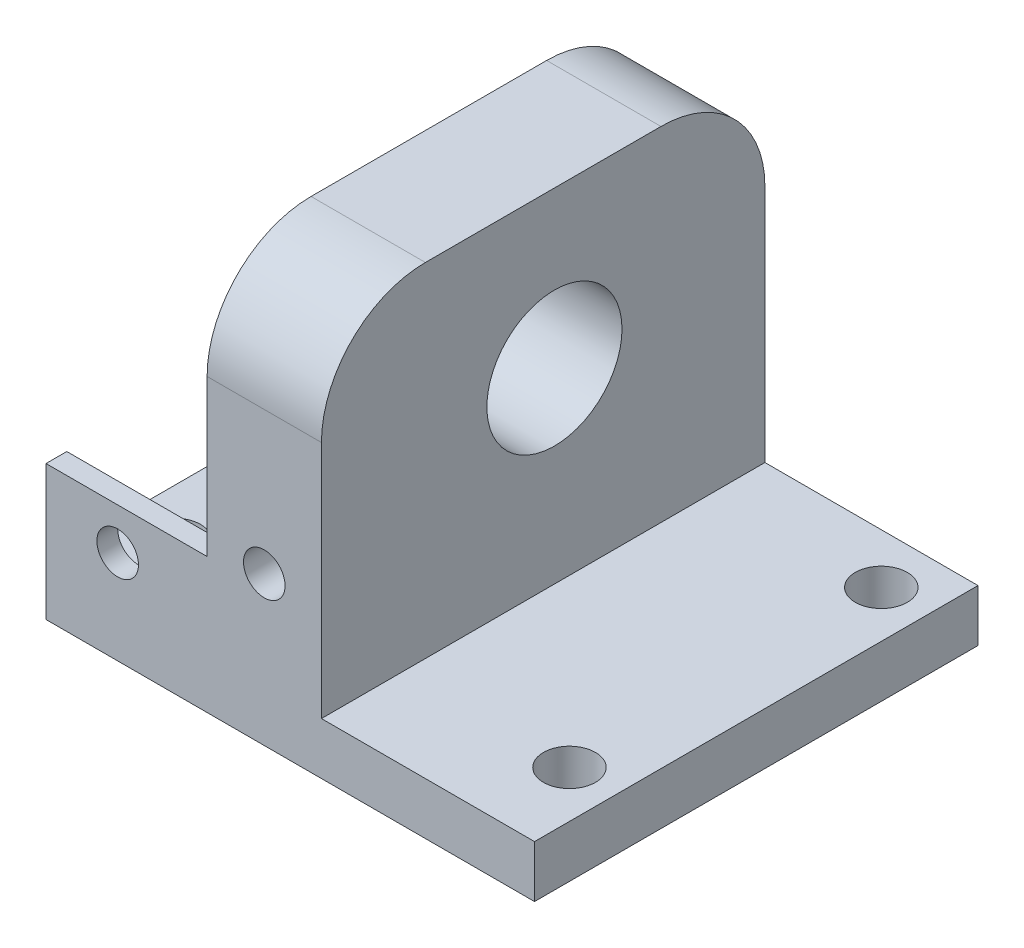
ISO-10303-21;
HEADER;
FILE_DESCRIPTION(('STEP AP214'),'2;1');
FILE_NAME('part.step','',(''),(''),'','','');
FILE_SCHEMA(('AUTOMOTIVE_DESIGN { 1 0 10303 214 1 1 1 1 }'));
ENDSEC;
DATA;
#1=APPLICATION_CONTEXT('core data for automotive mechanical design processes');
#2=APPLICATION_PROTOCOL_DEFINITION('international standard','automotive_design',2000,#1);
#3=PRODUCT_CONTEXT('',#1,'mechanical');
#4=PRODUCT('Part','Part','',(#3));
#5=PRODUCT_RELATED_PRODUCT_CATEGORY('part','',(#4));
#6=PRODUCT_DEFINITION_FORMATION('','',#4);
#7=PRODUCT_DEFINITION_CONTEXT('part definition',#1,'design');
#8=PRODUCT_DEFINITION('design','',#6,#7);
#9=PRODUCT_DEFINITION_SHAPE('','',#8);
#10=(LENGTH_UNIT() NAMED_UNIT(*) SI_UNIT(.MILLI.,.METRE.));
#11=(NAMED_UNIT(*) PLANE_ANGLE_UNIT() SI_UNIT($,.RADIAN.));
#12=(NAMED_UNIT(*) SI_UNIT($,.STERADIAN.) SOLID_ANGLE_UNIT());
#13=UNCERTAINTY_MEASURE_WITH_UNIT(LENGTH_MEASURE(1.E-05),#10,'distance_accuracy_value','');
#14=(GEOMETRIC_REPRESENTATION_CONTEXT(3) GLOBAL_UNCERTAINTY_ASSIGNED_CONTEXT((#13)) GLOBAL_UNIT_ASSIGNED_CONTEXT((#10,
#11,#12)) REPRESENTATION_CONTEXT('',''));
#15=CARTESIAN_POINT('',(0.,0.,0.));
#16=DIRECTION('',(0.,0.,1.));
#17=DIRECTION('',(1.,0.,0.));
#18=AXIS2_PLACEMENT_3D('',#15,#16,#17);
#19=CARTESIAN_POINT('',(0.,13.,0.));
#20=DIRECTION('',(0.,1.,0.));
#21=DIRECTION('',(0.,0.,-1.));
#22=AXIS2_PLACEMENT_3D('',#19,#20,#21);
#23=PLANE('',#22);
#24=CARTESIAN_POINT('',(-10.,13.,25.7045662951631));
#25=DIRECTION('',(0.,-1.,0.));
#26=DIRECTION('',(0.,0.,-1.));
#27=AXIS2_PLACEMENT_3D('',#24,#25,#26);
#28=CIRCLE('',#27,2.);
#29=CARTESIAN_POINT('',(-10.,13.,27.7045662951631));
#30=VERTEX_POINT('',#29);
#31=CARTESIAN_POINT('',(-8.,13.,25.7045662951631));
#32=VERTEX_POINT('',#31);
#33=EDGE_CURVE('E242',#30,#32,#28,.F.);
#34=ORIENTED_EDGE('',*,*,#33,.F.);
#35=DIRECTION('',(1.,0.,0.));
#36=VECTOR('',#35,1.);
#37=CARTESIAN_POINT('',(0.,13.,27.7045662951631));
#38=LINE('',#37,#36);
#39=CARTESIAN_POINT('',(-23.5,13.,27.7045662951631));
#40=VERTEX_POINT('',#39);
#41=EDGE_CURVE('E166',#40,#30,#38,.T.);
#42=ORIENTED_EDGE('',*,*,#41,.F.);
#43=DIRECTION('',(0.,0.,1.));
#44=VECTOR('',#43,1.);
#45=CARTESIAN_POINT('',(-23.5,13.,0.));
#46=LINE('',#45,#44);
#47=CARTESIAN_POINT('',(-23.5,13.,29.7045662951631));
#48=VERTEX_POINT('',#47);
#49=EDGE_CURVE('E160',#40,#48,#46,.T.);
#50=ORIENTED_EDGE('',*,*,#49,.T.);
#51=DIRECTION('',(-1.,0.,0.));
#52=VECTOR('',#51,1.);
#53=CARTESIAN_POINT('',(0.,13.,29.7045662951631));
#54=LINE('',#53,#52);
#55=CARTESIAN_POINT('',(-8.,13.,29.7045662951631));
#56=VERTEX_POINT('',#55);
#57=EDGE_CURVE('E142',#56,#48,#54,.T.);
#58=ORIENTED_EDGE('',*,*,#57,.F.);
#59=DIRECTION('',(0.,0.,-1.));
#60=VECTOR('',#59,1.);
#61=CARTESIAN_POINT('',(-8.,13.,22.2925073687534));
#62=LINE('',#61,#60);
#63=EDGE_CURVE('E146',#56,#32,#62,.T.);
#64=ORIENTED_EDGE('',*,*,#63,.T.);
#65=EDGE_LOOP('',(#34,#42,#50,#58,#64));
#66=FACE_BOUND('',#65,.T.);
#67=ADVANCED_FACE('F43',(#66),#23,.T.);
#68=CARTESIAN_POINT('',(0.,38.,27.7045662951631));
#69=DIRECTION('',(0.,0.,1.));
#70=DIRECTION('',(-1.,0.,0.));
#71=AXIS2_PLACEMENT_3D('',#68,#69,#70);
#72=PLANE('',#71);
#73=CARTESIAN_POINT('',(-16.6031759190852,9.,27.7045662951631));
#74=DIRECTION('',(0.,0.,-1.));
#75=DIRECTION('',(-1.,0.,0.));
#76=AXIS2_PLACEMENT_3D('',#73,#74,#75);
#77=CIRCLE('',#76,2.);
#78=CARTESIAN_POINT('',(-18.6031759190852,9.,27.7045662951631));
#79=VERTEX_POINT('',#78);
#80=EDGE_CURVE('E156',#79,#79,#77,.T.);
#81=ORIENTED_EDGE('',*,*,#80,.F.);
#82=EDGE_LOOP('',(#81));
#83=FACE_BOUND('',#82,.T.);
#84=DIRECTION('',(1.,0.,0.));
#85=VECTOR('',#84,1.);
#86=CARTESIAN_POINT('',(0.,5.,27.7045662951631));
#87=LINE('',#86,#85);
#88=CARTESIAN_POINT('',(-23.5,5.,27.7045662951631));
#89=VERTEX_POINT('',#88);
#90=CARTESIAN_POINT('',(-10.,5.,27.7045662951631));
#91=VERTEX_POINT('',#90);
#92=EDGE_CURVE('E174',#89,#91,#87,.T.);
#93=ORIENTED_EDGE('',*,*,#92,.F.);
#94=DIRECTION('',(0.,-1.,0.));
#95=VECTOR('',#94,1.);
#96=CARTESIAN_POINT('',(-23.5,38.,27.7045662951631));
#97=LINE('',#96,#95);
#98=EDGE_CURVE('E180',#40,#89,#97,.T.);
#99=ORIENTED_EDGE('',*,*,#98,.F.);
#100=ORIENTED_EDGE('',*,*,#41,.T.);
#101=DIRECTION('',(0.,-1.,0.));
#102=VECTOR('',#101,1.);
#103=CARTESIAN_POINT('',(-10.,13.,27.7045662951631));
#104=LINE('',#103,#102);
#105=EDGE_CURVE('E240',#91,#30,#104,.F.);
#106=ORIENTED_EDGE('',*,*,#105,.F.);
#107=EDGE_LOOP('',(#93,#99,#100,#106));
#108=FACE_BOUND('',#107,.T.);
#109=ADVANCED_FACE('F280',(#83,#108),#72,.F.);
#110=CARTESIAN_POINT('',(0.,5.,0.));
#111=DIRECTION('',(0.,1.,0.));
#112=DIRECTION('',(0.,0.,-1.));
#113=AXIS2_PLACEMENT_3D('',#110,#111,#112);
#114=PLANE('',#113);
#115=CARTESIAN_POINT('',(-19.,5.,21.8424323695947));
#116=DIRECTION('',(0.,-1.,0.));
#117=DIRECTION('',(0.,0.,-1.));
#118=AXIS2_PLACEMENT_3D('',#115,#116,#117);
#119=CIRCLE('',#118,2.5);
#120=CARTESIAN_POINT('',(-19.,5.,19.3424323695947));
#121=VERTEX_POINT('',#120);
#122=EDGE_CURVE('E194',#121,#121,#119,.T.);
#123=ORIENTED_EDGE('',*,*,#122,.T.);
#124=EDGE_LOOP('',(#123));
#125=FACE_BOUND('',#124,.T.);
#126=CARTESIAN_POINT('',(-19.,5.,-8.15756763040534));
#127=DIRECTION('',(0.,-1.,0.));
#128=DIRECTION('',(0.,0.,-1.));
#129=AXIS2_PLACEMENT_3D('',#126,#127,#128);
#130=CIRCLE('',#129,2.5);
#131=CARTESIAN_POINT('',(-19.,5.,-10.6575676304053));
#132=VERTEX_POINT('',#131);
#133=EDGE_CURVE('E187',#132,#132,#130,.T.);
#134=ORIENTED_EDGE('',*,*,#133,.T.);
#135=EDGE_LOOP('',(#134));
#136=FACE_BOUND('',#135,.T.);
#137=DIRECTION('',(0.,0.,-1.));
#138=VECTOR('',#137,1.);
#139=CARTESIAN_POINT('',(-8.,5.,27.7045662951631));
#140=LINE('',#139,#138);
#141=CARTESIAN_POINT('',(-8.,5.,25.7045662951631));
#142=VERTEX_POINT('',#141);
#143=CARTESIAN_POINT('',(-8.,5.,-12.9607154678039));
#144=VERTEX_POINT('',#143);
#145=EDGE_CURVE('E272',#142,#144,#140,.T.);
#146=ORIENTED_EDGE('',*,*,#145,.T.);
#147=DIRECTION('',(-1.,0.,0.));
#148=VECTOR('',#147,1.);
#149=CARTESIAN_POINT('',(0.,5.,-12.9607154678039));
#150=LINE('',#149,#148);
#151=CARTESIAN_POINT('',(-23.5,5.,-12.9607154678039));
#152=VERTEX_POINT('',#151);
#153=EDGE_CURVE('E199',#144,#152,#150,.T.);
#154=ORIENTED_EDGE('',*,*,#153,.T.);
#155=DIRECTION('',(0.,0.,1.));
#156=VECTOR('',#155,1.);
#157=CARTESIAN_POINT('',(-23.5,5.,0.));
#158=LINE('',#157,#156);
#159=EDGE_CURVE('E197',#152,#89,#158,.T.);
#160=ORIENTED_EDGE('',*,*,#159,.T.);
#161=ORIENTED_EDGE('',*,*,#92,.T.);
#162=CARTESIAN_POINT('',(-10.,5.,25.7045662951631));
#163=DIRECTION('',(0.,-1.,0.));
#164=DIRECTION('',(0.,0.,-1.));
#165=AXIS2_PLACEMENT_3D('',#162,#163,#164);
#166=CIRCLE('',#165,2.);
#167=EDGE_CURVE('E238',#142,#91,#166,.T.);
#168=ORIENTED_EDGE('',*,*,#167,.F.);
#169=EDGE_LOOP('',(#146,#154,#160,#161,#168));
#170=FACE_BOUND('',#169,.T.);
#171=ADVANCED_FACE('F286',(#125,#136,#170),#114,.T.);
#172=CARTESIAN_POINT('',(-23.5,5.,0.));
#173=DIRECTION('',(-1.,0.,0.));
#174=DIRECTION('',(0.,0.,-1.));
#175=AXIS2_PLACEMENT_3D('',#172,#173,#174);
#176=PLANE('',#175);
#177=ORIENTED_EDGE('',*,*,#98,.T.);
#178=ORIENTED_EDGE('',*,*,#159,.F.);
#179=DIRECTION('',(0.,-1.,0.));
#180=VECTOR('',#179,1.);
#181=CARTESIAN_POINT('',(-23.5,5.,-12.9607154678039));
#182=LINE('',#181,#180);
#183=CARTESIAN_POINT('',(-23.5,0.,-12.9607154678039));
#184=VERTEX_POINT('',#183);
#185=EDGE_CURVE('E234',#152,#184,#182,.T.);
#186=ORIENTED_EDGE('',*,*,#185,.T.);
#187=DIRECTION('',(0.,0.,1.));
#188=VECTOR('',#187,1.);
#189=CARTESIAN_POINT('',(-23.5,0.,0.));
#190=LINE('',#189,#188);
#191=CARTESIAN_POINT('',(-23.5,0.,29.7045662951631));
#192=VERTEX_POINT('',#191);
#193=EDGE_CURVE('E218',#184,#192,#190,.T.);
#194=ORIENTED_EDGE('',*,*,#193,.T.);
#195=DIRECTION('',(0.,-1.,0.));
#196=VECTOR('',#195,1.);
#197=CARTESIAN_POINT('',(-23.5,5.,29.7045662951631));
#198=LINE('',#197,#196);
#199=EDGE_CURVE('E206',#48,#192,#198,.T.);
#200=ORIENTED_EDGE('',*,*,#199,.F.);
#201=ORIENTED_EDGE('',*,*,#49,.F.);
#202=EDGE_LOOP('',(#177,#178,#186,#194,#200,#201));
#203=FACE_BOUND('',#202,.T.);
#204=ADVANCED_FACE('F319',(#203),#176,.T.);
#205=CARTESIAN_POINT('',(23.5,5.,0.));
#206=DIRECTION('',(-1.,0.,0.));
#207=DIRECTION('',(0.,0.,-1.));
#208=AXIS2_PLACEMENT_3D('',#205,#206,#207);
#209=PLANE('',#208);
#210=DIRECTION('',(0.,-1.,0.));
#211=VECTOR('',#210,1.);
#212=CARTESIAN_POINT('',(23.5,5.,29.7045662951631));
#213=LINE('',#212,#211);
#214=CARTESIAN_POINT('',(23.5,5.,29.7045662951631));
#215=VERTEX_POINT('',#214);
#216=CARTESIAN_POINT('',(23.5,0.,29.7045662951631));
#217=VERTEX_POINT('',#216);
#218=EDGE_CURVE('E228',#215,#217,#213,.T.);
#219=ORIENTED_EDGE('',*,*,#218,.T.);
#220=DIRECTION('',(0.,0.,1.));
#221=VECTOR('',#220,1.);
#222=CARTESIAN_POINT('',(23.5,0.,0.));
#223=LINE('',#222,#221);
#224=CARTESIAN_POINT('',(23.5,0.,-12.9607154678039));
#225=VERTEX_POINT('',#224);
#226=EDGE_CURVE('E223',#225,#217,#223,.T.);
#227=ORIENTED_EDGE('',*,*,#226,.F.);
#228=DIRECTION('',(0.,-1.,0.));
#229=VECTOR('',#228,1.);
#230=CARTESIAN_POINT('',(23.5,5.,-12.9607154678039));
#231=LINE('',#230,#229);
#232=CARTESIAN_POINT('',(23.5,5.,-12.9607154678039));
#233=VERTEX_POINT('',#232);
#234=EDGE_CURVE('E231',#233,#225,#231,.T.);
#235=ORIENTED_EDGE('',*,*,#234,.F.);
#236=DIRECTION('',(0.,0.,1.));
#237=VECTOR('',#236,1.);
#238=CARTESIAN_POINT('',(23.5,5.,0.));
#239=LINE('',#238,#237);
#240=EDGE_CURVE('E203',#233,#215,#239,.T.);
#241=ORIENTED_EDGE('',*,*,#240,.T.);
#242=EDGE_LOOP('',(#219,#227,#235,#241));
#243=FACE_BOUND('',#242,.T.);
#244=ADVANCED_FACE('F341',(#243),#209,.F.);
#245=CARTESIAN_POINT('',(0.,5.,29.7045662951631));
#246=DIRECTION('',(0.,0.,-1.));
#247=DIRECTION('',(1.,0.,0.));
#248=AXIS2_PLACEMENT_3D('',#245,#246,#247);
#249=PLANE('',#248);
#250=CARTESIAN_POINT('',(-16.6031759190852,9.,29.7045662951631));
#251=DIRECTION('',(0.,0.,-1.));
#252=DIRECTION('',(-1.,0.,0.));
#253=AXIS2_PLACEMENT_3D('',#250,#251,#252);
#254=CIRCLE('',#253,2.);
#255=CARTESIAN_POINT('',(-18.6031759190852,9.,29.7045662951631));
#256=VERTEX_POINT('',#255);
#257=EDGE_CURVE('E294',#256,#256,#254,.T.);
#258=ORIENTED_EDGE('',*,*,#257,.T.);
#259=EDGE_LOOP('',(#258));
#260=FACE_BOUND('',#259,.T.);
#261=CARTESIAN_POINT('',(-2.5,14.3094116682529,29.7045662951631));
#262=DIRECTION('',(0.,0.,-1.));
#263=DIRECTION('',(-1.,0.,0.));
#264=AXIS2_PLACEMENT_3D('',#261,#262,#263);
#265=CIRCLE('',#264,2.);
#266=CARTESIAN_POINT('',(-4.5,14.3094116682529,29.7045662951631));
#267=VERTEX_POINT('',#266);
#268=EDGE_CURVE('E295',#267,#267,#265,.T.);
#269=ORIENTED_EDGE('',*,*,#268,.T.);
#270=EDGE_LOOP('',(#269));
#271=FACE_BOUND('',#270,.T.);
#272=DIRECTION('',(0.,-1.,0.));
#273=VECTOR('',#272,1.);
#274=CARTESIAN_POINT('',(-8.,38.,29.7045662951631));
#275=LINE('',#274,#273);
#276=CARTESIAN_POINT('',(-8.,28.,29.7045662951631));
#277=VERTEX_POINT('',#276);
#278=EDGE_CURVE('E137',#277,#56,#275,.T.);
#279=ORIENTED_EDGE('',*,*,#278,.T.);
#280=ORIENTED_EDGE('',*,*,#57,.T.);
#281=ORIENTED_EDGE('',*,*,#199,.T.);
#282=DIRECTION('',(-1.,0.,0.));
#283=VECTOR('',#282,1.);
#284=CARTESIAN_POINT('',(0.,0.,29.7045662951631));
#285=LINE('',#284,#283);
#286=EDGE_CURVE('E188',#217,#192,#285,.T.);
#287=ORIENTED_EDGE('',*,*,#286,.F.);
#288=ORIENTED_EDGE('',*,*,#218,.F.);
#289=DIRECTION('',(1.,0.,0.));
#290=VECTOR('',#289,1.);
#291=CARTESIAN_POINT('',(0.,5.,29.7045662951631));
#292=LINE('',#291,#290);
#293=CARTESIAN_POINT('',(3.,5.,29.7045662951631));
#294=VERTEX_POINT('',#293);
#295=EDGE_CURVE('E270',#294,#215,#292,.T.);
#296=ORIENTED_EDGE('',*,*,#295,.F.);
#297=DIRECTION('',(0.,-1.,0.));
#298=VECTOR('',#297,1.);
#299=CARTESIAN_POINT('',(3.,5.,29.7045662951631));
#300=LINE('',#299,#298);
#301=CARTESIAN_POINT('',(3.,28.,29.7045662951631));
#302=VERTEX_POINT('',#301);
#303=EDGE_CURVE('E266',#302,#294,#300,.T.);
#304=ORIENTED_EDGE('',*,*,#303,.F.);
#305=DIRECTION('',(-1.,0.,0.));
#306=VECTOR('',#305,1.);
#307=CARTESIAN_POINT('',(3.,28.,29.7045662951631));
#308=LINE('',#307,#306);
#309=EDGE_CURVE('E11',#277,#302,#308,.F.);
#310=ORIENTED_EDGE('',*,*,#309,.F.);
#311=EDGE_LOOP('',(#279,#280,#281,#287,#288,#296,#304,#310));
#312=FACE_BOUND('',#311,.T.);
#313=ADVANCED_FACE('F139',(#260,#271,#312),#249,.F.);
#314=CARTESIAN_POINT('',(0.,5.,-12.9607154678039));
#315=DIRECTION('',(0.,0.,-1.));
#316=DIRECTION('',(1.,0.,0.));
#317=AXIS2_PLACEMENT_3D('',#314,#315,#316);
#318=PLANE('',#317);
#319=DIRECTION('',(0.,-1.,0.));
#320=VECTOR('',#319,1.);
#321=CARTESIAN_POINT('',(3.,38.,-12.9607154678039));
#322=LINE('',#321,#320);
#323=CARTESIAN_POINT('',(3.,28.,-12.9607154678039));
#324=VERTEX_POINT('',#323);
#325=CARTESIAN_POINT('',(3.,5.,-12.9607154678039));
#326=VERTEX_POINT('',#325);
#327=EDGE_CURVE('E173',#324,#326,#322,.T.);
#328=ORIENTED_EDGE('',*,*,#327,.T.);
#329=EDGE_CURVE('E200',#233,#326,#150,.T.);
#330=ORIENTED_EDGE('',*,*,#329,.F.);
#331=ORIENTED_EDGE('',*,*,#234,.T.);
#332=DIRECTION('',(-1.,0.,0.));
#333=VECTOR('',#332,1.);
#334=CARTESIAN_POINT('',(0.,0.,-12.9607154678039));
#335=LINE('',#334,#333);
#336=EDGE_CURVE('E221',#225,#184,#335,.T.);
#337=ORIENTED_EDGE('',*,*,#336,.T.);
#338=ORIENTED_EDGE('',*,*,#185,.F.);
#339=ORIENTED_EDGE('',*,*,#153,.F.);
#340=DIRECTION('',(0.,1.,0.));
#341=VECTOR('',#340,1.);
#342=CARTESIAN_POINT('',(-8.,5.,-12.9607154678039));
#343=LINE('',#342,#341);
#344=CARTESIAN_POINT('',(-8.,28.,-12.9607154678039));
#345=VERTEX_POINT('',#344);
#346=EDGE_CURVE('E267',#144,#345,#343,.T.);
#347=ORIENTED_EDGE('',*,*,#346,.T.);
#348=DIRECTION('',(1.,0.,0.));
#349=VECTOR('',#348,1.);
#350=CARTESIAN_POINT('',(0.,28.,-12.9607154678039));
#351=LINE('',#350,#349);
#352=EDGE_CURVE('E253',#324,#345,#351,.F.);
#353=ORIENTED_EDGE('',*,*,#352,.F.);
#354=EDGE_LOOP('',(#328,#330,#331,#337,#338,#339,#347,#353));
#355=FACE_BOUND('',#354,.T.);
#356=ADVANCED_FACE('F340',(#355),#318,.T.);
#357=CARTESIAN_POINT('',(-19.,5.,21.8424323695947));
#358=DIRECTION('',(0.,-1.,0.));
#359=DIRECTION('',(0.,0.,1.));
#360=AXIS2_PLACEMENT_3D('',#357,#358,#359);
#361=CYLINDRICAL_SURFACE('',#360,2.5);
#362=ORIENTED_EDGE('',*,*,#122,.F.);
#363=EDGE_LOOP('',(#362));
#364=FACE_BOUND('',#363,.T.);
#365=CARTESIAN_POINT('',(-19.,0.,21.8424323695947));
#366=DIRECTION('',(0.,-1.,0.));
#367=DIRECTION('',(0.,0.,-1.));
#368=AXIS2_PLACEMENT_3D('',#365,#366,#367);
#369=CIRCLE('',#368,2.5);
#370=CARTESIAN_POINT('',(-19.,0.,19.3424323695947));
#371=VERTEX_POINT('',#370);
#372=EDGE_CURVE('E215',#371,#371,#369,.T.);
#373=ORIENTED_EDGE('',*,*,#372,.T.);
#374=EDGE_LOOP('',(#373));
#375=FACE_BOUND('',#374,.T.);
#376=ADVANCED_FACE('F347',(#364,#375),#361,.F.);
#377=CARTESIAN_POINT('',(19.,5.,21.8424323695946));
#378=DIRECTION('',(0.,-1.,0.));
#379=DIRECTION('',(0.,0.,1.));
#380=AXIS2_PLACEMENT_3D('',#377,#378,#379);
#381=CYLINDRICAL_SURFACE('',#380,2.5);
#382=CARTESIAN_POINT('',(19.,5.,21.8424323695946));
#383=DIRECTION('',(0.,-1.,0.));
#384=DIRECTION('',(0.,0.,-1.));
#385=AXIS2_PLACEMENT_3D('',#382,#383,#384);
#386=CIRCLE('',#385,2.5);
#387=CARTESIAN_POINT('',(19.,5.,19.3424323695946));
#388=VERTEX_POINT('',#387);
#389=EDGE_CURVE('E191',#388,#388,#386,.T.);
#390=ORIENTED_EDGE('',*,*,#389,.F.);
#391=EDGE_LOOP('',(#390));
#392=FACE_BOUND('',#391,.T.);
#393=CARTESIAN_POINT('',(19.,0.,21.8424323695946));
#394=DIRECTION('',(0.,-1.,0.));
#395=DIRECTION('',(0.,0.,-1.));
#396=AXIS2_PLACEMENT_3D('',#393,#394,#395);
#397=CIRCLE('',#396,2.5);
#398=CARTESIAN_POINT('',(19.,0.,19.3424323695946));
#399=VERTEX_POINT('',#398);
#400=EDGE_CURVE('E212',#399,#399,#397,.T.);
#401=ORIENTED_EDGE('',*,*,#400,.T.);
#402=EDGE_LOOP('',(#401));
#403=FACE_BOUND('',#402,.T.);
#404=ADVANCED_FACE('F354',(#392,#403),#381,.F.);
#405=CARTESIAN_POINT('',(-19.,5.,-8.15756763040534));
#406=DIRECTION('',(0.,-1.,0.));
#407=DIRECTION('',(0.,0.,1.));
#408=AXIS2_PLACEMENT_3D('',#405,#406,#407);
#409=CYLINDRICAL_SURFACE('',#408,2.5);
#410=ORIENTED_EDGE('',*,*,#133,.F.);
#411=EDGE_LOOP('',(#410));
#412=FACE_BOUND('',#411,.T.);
#413=CARTESIAN_POINT('',(-19.,0.,-8.15756763040534));
#414=DIRECTION('',(0.,-1.,0.));
#415=DIRECTION('',(0.,0.,-1.));
#416=AXIS2_PLACEMENT_3D('',#413,#414,#415);
#417=CIRCLE('',#416,2.5);
#418=CARTESIAN_POINT('',(-19.,0.,-10.6575676304053));
#419=VERTEX_POINT('',#418);
#420=EDGE_CURVE('E209',#419,#419,#417,.T.);
#421=ORIENTED_EDGE('',*,*,#420,.T.);
#422=EDGE_LOOP('',(#421));
#423=FACE_BOUND('',#422,.T.);
#424=ADVANCED_FACE('F358',(#412,#423),#409,.F.);
#425=CARTESIAN_POINT('',(19.,5.,-8.15756763040534));
#426=DIRECTION('',(0.,-1.,0.));
#427=DIRECTION('',(0.,0.,1.));
#428=AXIS2_PLACEMENT_3D('',#425,#426,#427);
#429=CYLINDRICAL_SURFACE('',#428,2.5);
#430=CARTESIAN_POINT('',(19.,5.,-8.15756763040534));
#431=DIRECTION('',(0.,-1.,0.));
#432=DIRECTION('',(0.,0.,-1.));
#433=AXIS2_PLACEMENT_3D('',#430,#431,#432);
#434=CIRCLE('',#433,2.5);
#435=CARTESIAN_POINT('',(19.,5.,-10.6575676304053));
#436=VERTEX_POINT('',#435);
#437=EDGE_CURVE('E184',#436,#436,#434,.T.);
#438=ORIENTED_EDGE('',*,*,#437,.F.);
#439=EDGE_LOOP('',(#438));
#440=FACE_BOUND('',#439,.T.);
#441=CARTESIAN_POINT('',(19.,0.,-8.15756763040534));
#442=DIRECTION('',(0.,-1.,0.));
#443=DIRECTION('',(0.,0.,-1.));
#444=AXIS2_PLACEMENT_3D('',#441,#442,#443);
#445=CIRCLE('',#444,2.5);
#446=CARTESIAN_POINT('',(19.,0.,-10.6575676304053));
#447=VERTEX_POINT('',#446);
#448=EDGE_CURVE('E183',#447,#447,#445,.T.);
#449=ORIENTED_EDGE('',*,*,#448,.T.);
#450=EDGE_LOOP('',(#449));
#451=FACE_BOUND('',#450,.T.);
#452=ADVANCED_FACE('F333',(#440,#451),#429,.F.);
#453=DIRECTION('',(0.,0.,1.));
#454=VECTOR('',#453,1.);
#455=CARTESIAN_POINT('',(3.,5.,0.));
#456=LINE('',#455,#454);
#457=EDGE_CURVE('E164',#326,#294,#456,.T.);
#458=ORIENTED_EDGE('',*,*,#457,.T.);
#459=ORIENTED_EDGE('',*,*,#295,.T.);
#460=ORIENTED_EDGE('',*,*,#240,.F.);
#461=ORIENTED_EDGE('',*,*,#329,.T.);
#462=EDGE_LOOP('',(#458,#459,#460,#461));
#463=FACE_BOUND('',#462,.T.);
#464=ORIENTED_EDGE('',*,*,#437,.T.);
#465=EDGE_LOOP('',(#464));
#466=FACE_BOUND('',#465,.T.);
#467=ORIENTED_EDGE('',*,*,#389,.T.);
#468=EDGE_LOOP('',(#467));
#469=FACE_BOUND('',#468,.T.);
#470=ADVANCED_FACE('F322',(#463,#466,#469),#114,.T.);
#471=CARTESIAN_POINT('',(0.,0.,0.));
#472=DIRECTION('',(0.,1.,0.));
#473=DIRECTION('',(0.,0.,-1.));
#474=AXIS2_PLACEMENT_3D('',#471,#472,#473);
#475=PLANE('',#474);
#476=ORIENTED_EDGE('',*,*,#448,.F.);
#477=EDGE_LOOP('',(#476));
#478=FACE_BOUND('',#477,.T.);
#479=ORIENTED_EDGE('',*,*,#420,.F.);
#480=EDGE_LOOP('',(#479));
#481=FACE_BOUND('',#480,.T.);
#482=ORIENTED_EDGE('',*,*,#400,.F.);
#483=EDGE_LOOP('',(#482));
#484=FACE_BOUND('',#483,.T.);
#485=ORIENTED_EDGE('',*,*,#372,.F.);
#486=EDGE_LOOP('',(#485));
#487=FACE_BOUND('',#486,.T.);
#488=ORIENTED_EDGE('',*,*,#193,.F.);
#489=ORIENTED_EDGE('',*,*,#336,.F.);
#490=ORIENTED_EDGE('',*,*,#226,.T.);
#491=ORIENTED_EDGE('',*,*,#286,.T.);
#492=EDGE_LOOP('',(#488,#489,#490,#491));
#493=FACE_BOUND('',#492,.T.);
#494=ADVANCED_FACE('F329',(#478,#481,#484,#487,#493),#475,.F.);
#495=CARTESIAN_POINT('',(3.,38.,0.));
#496=DIRECTION('',(-1.,0.,0.));
#497=DIRECTION('',(0.,0.,-1.));
#498=AXIS2_PLACEMENT_3D('',#495,#496,#497);
#499=PLANE('',#498);
#500=DIRECTION('',(0.,0.,1.));
#501=VECTOR('',#500,1.);
#502=CARTESIAN_POINT('',(3.,38.,0.));
#503=LINE('',#502,#501);
#504=CARTESIAN_POINT('',(3.,38.,-2.96071546780391));
#505=VERTEX_POINT('',#504);
#506=CARTESIAN_POINT('',(3.,38.,19.7045662951631));
#507=VERTEX_POINT('',#506);
#508=EDGE_CURVE('E170',#505,#507,#503,.T.);
#509=ORIENTED_EDGE('',*,*,#508,.T.);
#510=CARTESIAN_POINT('',(3.,28.,19.7045662951631));
#511=DIRECTION('',(1.,0.,0.));
#512=DIRECTION('',(0.,0.,-1.));
#513=AXIS2_PLACEMENT_3D('',#510,#511,#512);
#514=CIRCLE('',#513,10.);
#515=EDGE_CURVE('E248',#302,#507,#514,.F.);
#516=ORIENTED_EDGE('',*,*,#515,.F.);
#517=ORIENTED_EDGE('',*,*,#303,.T.);
#518=ORIENTED_EDGE('',*,*,#457,.F.);
#519=ORIENTED_EDGE('',*,*,#327,.F.);
#520=CARTESIAN_POINT('',(3.,28.,-2.96071546780391));
#521=DIRECTION('',(1.,0.,0.));
#522=DIRECTION('',(0.,0.,-1.));
#523=AXIS2_PLACEMENT_3D('',#520,#521,#522);
#524=CIRCLE('',#523,10.);
#525=EDGE_CURVE('E251',#505,#324,#524,.F.);
#526=ORIENTED_EDGE('',*,*,#525,.F.);
#527=EDGE_LOOP('',(#509,#516,#517,#518,#519,#526));
#528=FACE_BOUND('',#527,.T.);
#529=CARTESIAN_POINT('',(3.,22.9956029714957,7.28945850344098));
#530=DIRECTION('',(1.,0.,0.));
#531=DIRECTION('',(0.,0.,-1.));
#532=AXIS2_PLACEMENT_3D('',#529,#530,#531);
#533=CIRCLE('',#532,6.5);
#534=CARTESIAN_POINT('',(3.,22.9956029714957,0.789458503440981));
#535=VERTEX_POINT('',#534);
#536=EDGE_CURVE('E161',#535,#535,#533,.T.);
#537=ORIENTED_EDGE('',*,*,#536,.F.);
#538=EDGE_LOOP('',(#537));
#539=FACE_BOUND('',#538,.T.);
#540=ADVANCED_FACE('F327',(#528,#539),#499,.F.);
#541=CARTESIAN_POINT('',(0.,38.,0.));
#542=DIRECTION('',(0.,1.,0.));
#543=DIRECTION('',(0.,0.,-1.));
#544=AXIS2_PLACEMENT_3D('',#541,#542,#543);
#545=PLANE('',#544);
#546=DIRECTION('',(0.,0.,1.));
#547=VECTOR('',#546,1.);
#548=CARTESIAN_POINT('',(-8.,38.,-12.9607154678039));
#549=LINE('',#548,#547);
#550=CARTESIAN_POINT('',(-8.,38.,-2.96071546780391));
#551=VERTEX_POINT('',#550);
#552=CARTESIAN_POINT('',(-8.,38.,19.7045662951631));
#553=VERTEX_POINT('',#552);
#554=EDGE_CURVE('E265',#551,#553,#549,.T.);
#555=ORIENTED_EDGE('',*,*,#554,.T.);
#556=DIRECTION('',(-1.,0.,0.));
#557=VECTOR('',#556,1.);
#558=CARTESIAN_POINT('',(-8.,38.,19.7045662951631));
#559=LINE('',#558,#557);
#560=EDGE_CURVE('E244',#507,#553,#559,.T.);
#561=ORIENTED_EDGE('',*,*,#560,.F.);
#562=ORIENTED_EDGE('',*,*,#508,.F.);
#563=DIRECTION('',(1.,0.,0.));
#564=VECTOR('',#563,1.);
#565=CARTESIAN_POINT('',(0.,38.,-2.96071546780391));
#566=LINE('',#565,#564);
#567=EDGE_CURVE('E246',#551,#505,#566,.T.);
#568=ORIENTED_EDGE('',*,*,#567,.F.);
#569=EDGE_LOOP('',(#555,#561,#562,#568));
#570=FACE_BOUND('',#569,.T.);
#571=ADVANCED_FACE('F264',(#570),#545,.T.);
#572=CARTESIAN_POINT('',(4.,22.9956029714957,7.28945850344098));
#573=DIRECTION('',(-1.,0.,0.));
#574=DIRECTION('',(0.,0.,-1.));
#575=AXIS2_PLACEMENT_3D('',#572,#573,#574);
#576=CYLINDRICAL_SURFACE('',#575,6.5);
#577=ORIENTED_EDGE('',*,*,#536,.T.);
#578=EDGE_LOOP('',(#577));
#579=FACE_BOUND('',#578,.T.);
#580=CARTESIAN_POINT('',(-8.,22.9956029714957,7.28945850344098));
#581=DIRECTION('',(1.,0.,0.));
#582=DIRECTION('',(0.,0.,-1.));
#583=AXIS2_PLACEMENT_3D('',#580,#581,#582);
#584=CIRCLE('',#583,6.5);
#585=CARTESIAN_POINT('',(-8.,22.9956029714957,0.789458503440981));
#586=VERTEX_POINT('',#585);
#587=EDGE_CURVE('E145',#586,#586,#584,.T.);
#588=ORIENTED_EDGE('',*,*,#587,.F.);
#589=EDGE_LOOP('',(#588));
#590=FACE_BOUND('',#589,.T.);
#591=ADVANCED_FACE('F404',(#579,#590),#576,.F.);
#592=CARTESIAN_POINT('',(-8.,0.,0.));
#593=DIRECTION('',(1.,0.,0.));
#594=DIRECTION('',(0.,0.,1.));
#595=AXIS2_PLACEMENT_3D('',#592,#593,#594);
#596=PLANE('',#595);
#597=ORIENTED_EDGE('',*,*,#346,.F.);
#598=ORIENTED_EDGE('',*,*,#145,.F.);
#599=DIRECTION('',(0.,-1.,0.));
#600=VECTOR('',#599,1.);
#601=CARTESIAN_POINT('',(-8.,5.,25.7045662951631));
#602=LINE('',#601,#600);
#603=EDGE_CURVE('E152',#32,#142,#602,.T.);
#604=ORIENTED_EDGE('',*,*,#603,.F.);
#605=ORIENTED_EDGE('',*,*,#63,.F.);
#606=ORIENTED_EDGE('',*,*,#278,.F.);
#607=CARTESIAN_POINT('',(-8.,28.,19.7045662951631));
#608=DIRECTION('',(-1.,0.,0.));
#609=DIRECTION('',(0.,0.,1.));
#610=AXIS2_PLACEMENT_3D('',#607,#608,#609);
#611=CIRCLE('',#610,10.);
#612=EDGE_CURVE('E57',#553,#277,#611,.F.);
#613=ORIENTED_EDGE('',*,*,#612,.F.);
#614=ORIENTED_EDGE('',*,*,#554,.F.);
#615=CARTESIAN_POINT('',(-8.,28.,-2.96071546780391));
#616=DIRECTION('',(-1.,0.,0.));
#617=DIRECTION('',(0.,0.,1.));
#618=AXIS2_PLACEMENT_3D('',#615,#616,#617);
#619=CIRCLE('',#618,10.);
#620=EDGE_CURVE('E51',#345,#551,#619,.F.);
#621=ORIENTED_EDGE('',*,*,#620,.F.);
#622=EDGE_LOOP('',(#597,#598,#604,#605,#606,#613,#614,#621));
#623=FACE_BOUND('',#622,.T.);
#624=ORIENTED_EDGE('',*,*,#587,.T.);
#625=EDGE_LOOP('',(#624));
#626=FACE_BOUND('',#625,.T.);
#627=ADVANCED_FACE('F149',(#623,#626),#596,.F.);
#628=CARTESIAN_POINT('',(-10.,0.,25.7045662951631));
#629=DIRECTION('',(0.,1.,0.));
#630=DIRECTION('',(0.,0.,-1.));
#631=AXIS2_PLACEMENT_3D('',#628,#629,#630);
#632=CYLINDRICAL_SURFACE('',#631,2.);
#633=ORIENTED_EDGE('',*,*,#33,.T.);
#634=ORIENTED_EDGE('',*,*,#603,.T.);
#635=ORIENTED_EDGE('',*,*,#167,.T.);
#636=ORIENTED_EDGE('',*,*,#105,.T.);
#637=EDGE_LOOP('',(#633,#634,#635,#636));
#638=FACE_BOUND('',#637,.T.);
#639=ADVANCED_FACE('F282',(#638),#632,.F.);
#640=CARTESIAN_POINT('',(0.,28.,-2.96071546780391));
#641=DIRECTION('',(1.,0.,0.));
#642=DIRECTION('',(0.,0.,1.));
#643=AXIS2_PLACEMENT_3D('',#640,#641,#642);
#644=CYLINDRICAL_SURFACE('',#643,10.);
#645=ORIENTED_EDGE('',*,*,#620,.T.);
#646=ORIENTED_EDGE('',*,*,#567,.T.);
#647=ORIENTED_EDGE('',*,*,#525,.T.);
#648=ORIENTED_EDGE('',*,*,#352,.T.);
#649=EDGE_LOOP('',(#645,#646,#647,#648));
#650=FACE_BOUND('',#649,.T.);
#651=ADVANCED_FACE('F257',(#650),#644,.T.);
#652=CARTESIAN_POINT('',(0.,28.,19.7045662951631));
#653=DIRECTION('',(1.,0.,0.));
#654=DIRECTION('',(0.,0.,1.));
#655=AXIS2_PLACEMENT_3D('',#652,#653,#654);
#656=CYLINDRICAL_SURFACE('',#655,10.);
#657=ORIENTED_EDGE('',*,*,#515,.T.);
#658=ORIENTED_EDGE('',*,*,#560,.T.);
#659=ORIENTED_EDGE('',*,*,#612,.T.);
#660=ORIENTED_EDGE('',*,*,#309,.T.);
#661=EDGE_LOOP('',(#657,#658,#659,#660));
#662=FACE_BOUND('',#661,.T.);
#663=ADVANCED_FACE('F45',(#662),#656,.T.);
#664=CARTESIAN_POINT('',(-2.5,14.3094116682529,25.7045662951631));
#665=DIRECTION('',(0.,0.,1.));
#666=DIRECTION('',(-1.,0.,0.));
#667=AXIS2_PLACEMENT_3D('',#664,#665,#666);
#668=CYLINDRICAL_SURFACE('',#667,2.);
#669=CARTESIAN_POINT('',(-2.5,14.3094116682529,25.7045662951631));
#670=DIRECTION('',(0.,0.,-1.));
#671=DIRECTION('',(-1.,0.,0.));
#672=AXIS2_PLACEMENT_3D('',#669,#670,#671);
#673=CIRCLE('',#672,2.);
#674=CARTESIAN_POINT('',(-4.5,14.3094116682529,25.7045662951631));
#675=VERTEX_POINT('',#674);
#676=EDGE_CURVE('E298',#675,#675,#673,.T.);
#677=ORIENTED_EDGE('',*,*,#676,.T.);
#678=EDGE_LOOP('',(#677));
#679=FACE_BOUND('',#678,.T.);
#680=ORIENTED_EDGE('',*,*,#268,.F.);
#681=EDGE_LOOP('',(#680));
#682=FACE_BOUND('',#681,.T.);
#683=ADVANCED_FACE('F371',(#679,#682),#668,.F.);
#684=CARTESIAN_POINT('',(0.,0.,25.7045662951631));
#685=DIRECTION('',(0.,0.,1.));
#686=DIRECTION('',(-1.,0.,0.));
#687=AXIS2_PLACEMENT_3D('',#684,#685,#686);
#688=PLANE('',#687);
#689=ORIENTED_EDGE('',*,*,#676,.F.);
#690=EDGE_LOOP('',(#689));
#691=FACE_BOUND('',#690,.T.);
#692=ADVANCED_FACE('F309',(#691),#688,.T.);
#693=CARTESIAN_POINT('',(-16.6031759190852,9.,25.7045662951631));
#694=DIRECTION('',(0.,0.,1.));
#695=DIRECTION('',(-1.,0.,0.));
#696=AXIS2_PLACEMENT_3D('',#693,#694,#695);
#697=CYLINDRICAL_SURFACE('',#696,2.);
#698=ORIENTED_EDGE('',*,*,#257,.F.);
#699=EDGE_LOOP('',(#698));
#700=FACE_BOUND('',#699,.T.);
#701=ORIENTED_EDGE('',*,*,#80,.T.);
#702=EDGE_LOOP('',(#701));
#703=FACE_BOUND('',#702,.T.);
#704=ADVANCED_FACE('F306',(#700,#703),#697,.F.);
#705=CLOSED_SHELL('',(#67,#109,#171,#204,#244,#313,#356,#376,#404,#424,#452,#470,#494,#540,#571,
#591,#627,#639,#651,#663,#683,#692,#704));
#706=MANIFOLD_SOLID_BREP('B2',#705);
#707=ADVANCED_BREP_SHAPE_REPRESENTATION('',(#18,#706),#14);
#708=SHAPE_DEFINITION_REPRESENTATION(#9,#707);
ENDSEC;
END-ISO-10303-21;
